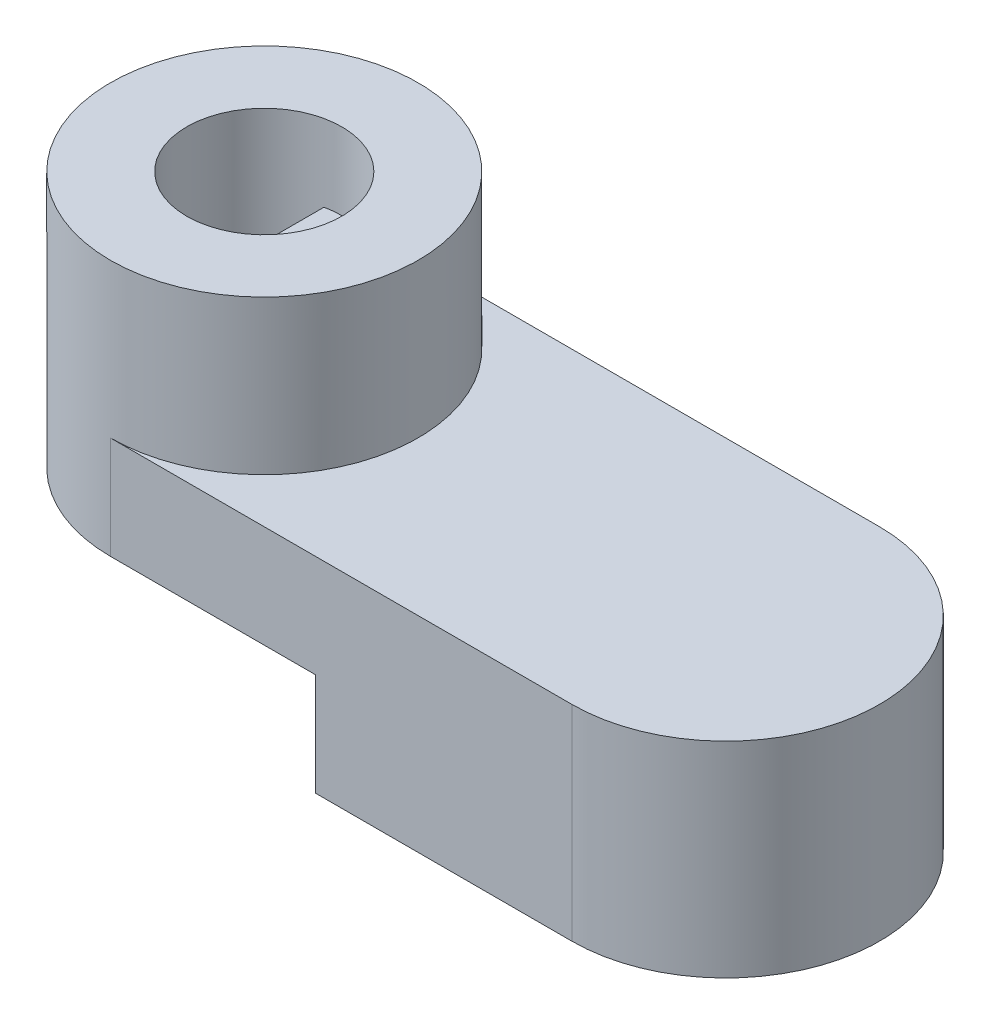
ISO-10303-21;
HEADER;
FILE_DESCRIPTION(('STEP AP214'),'2;1');
FILE_NAME('part.step','',(''),(''),'','','');
FILE_SCHEMA(('AUTOMOTIVE_DESIGN { 1 0 10303 214 1 1 1 1 }'));
ENDSEC;
DATA;
#1=APPLICATION_CONTEXT('core data for automotive mechanical design processes');
#2=APPLICATION_PROTOCOL_DEFINITION('international standard','automotive_design',2000,#1);
#3=PRODUCT_CONTEXT('',#1,'mechanical');
#4=PRODUCT('Part','Part','',(#3));
#5=PRODUCT_RELATED_PRODUCT_CATEGORY('part','',(#4));
#6=PRODUCT_DEFINITION_FORMATION('','',#4);
#7=PRODUCT_DEFINITION_CONTEXT('part definition',#1,'design');
#8=PRODUCT_DEFINITION('design','',#6,#7);
#9=PRODUCT_DEFINITION_SHAPE('','',#8);
#10=(LENGTH_UNIT() NAMED_UNIT(*) SI_UNIT(.MILLI.,.METRE.));
#11=(NAMED_UNIT(*) PLANE_ANGLE_UNIT() SI_UNIT($,.RADIAN.));
#12=(NAMED_UNIT(*) SI_UNIT($,.STERADIAN.) SOLID_ANGLE_UNIT());
#13=UNCERTAINTY_MEASURE_WITH_UNIT(LENGTH_MEASURE(1.E-05),#10,'distance_accuracy_value','');
#14=(GEOMETRIC_REPRESENTATION_CONTEXT(3) GLOBAL_UNCERTAINTY_ASSIGNED_CONTEXT((#13)) GLOBAL_UNIT_ASSIGNED_CONTEXT((#10,
#11,#12)) REPRESENTATION_CONTEXT('',''));
#15=CARTESIAN_POINT('',(0.,0.,0.));
#16=DIRECTION('',(0.,0.,1.));
#17=DIRECTION('',(1.,0.,0.));
#18=AXIS2_PLACEMENT_3D('',#15,#16,#17);
#19=CARTESIAN_POINT('',(-19.05,11.1125,0.));
#20=DIRECTION('',(0.,-1.,0.));
#21=DIRECTION('',(0.,0.,-1.));
#22=AXIS2_PLACEMENT_3D('',#19,#20,#21);
#23=CYLINDRICAL_SURFACE('',#22,2.4);
#24=CARTESIAN_POINT('',(-19.05,11.1125,0.));
#25=DIRECTION('',(0.,1.,0.));
#26=DIRECTION('',(0.,0.,1.));
#27=AXIS2_PLACEMENT_3D('',#24,#25,#26);
#28=CIRCLE('',#27,2.4);
#29=CARTESIAN_POINT('',(-19.05,11.1125,2.4));
#30=VERTEX_POINT('',#29);
#31=EDGE_CURVE('E139',#30,#30,#28,.T.);
#32=ORIENTED_EDGE('',*,*,#31,.T.);
#33=EDGE_LOOP('',(#32));
#34=FACE_BOUND('',#33,.T.);
#35=CARTESIAN_POINT('',(-19.05,8.73124999999999,0.));
#36=DIRECTION('',(0.,1.,0.));
#37=DIRECTION('',(0.,0.,1.));
#38=AXIS2_PLACEMENT_3D('',#35,#36,#37);
#39=CIRCLE('',#38,2.4);
#40=CARTESIAN_POINT('',(-18.55,8.73124999999999,-2.3473389188611));
#41=VERTEX_POINT('',#40);
#42=CARTESIAN_POINT('',(-19.55,8.73124999999999,-2.3473389188611));
#43=VERTEX_POINT('',#42);
#44=EDGE_CURVE('E53',#41,#43,#39,.T.);
#45=ORIENTED_EDGE('',*,*,#44,.F.);
#46=DIRECTION('',(0.,-1.,0.));
#47=VECTOR('',#46,1.);
#48=CARTESIAN_POINT('',(-18.55,8.73124999999999,-2.3473389188611));
#49=LINE('',#48,#47);
#50=CARTESIAN_POINT('',(-18.55,6.34999999999999,-2.3473389188611));
#51=VERTEX_POINT('',#50);
#52=EDGE_CURVE('E135',#41,#51,#49,.T.);
#53=ORIENTED_EDGE('',*,*,#52,.T.);
#54=CARTESIAN_POINT('',(-19.05,6.34999999999999,0.));
#55=DIRECTION('',(0.,1.,0.));
#56=DIRECTION('',(0.,0.,1.));
#57=AXIS2_PLACEMENT_3D('',#54,#55,#56);
#58=CIRCLE('',#57,2.4);
#59=CARTESIAN_POINT('',(-18.55,6.34999999999999,2.3473389188611));
#60=VERTEX_POINT('',#59);
#61=EDGE_CURVE('E113',#60,#51,#58,.T.);
#62=ORIENTED_EDGE('',*,*,#61,.F.);
#63=DIRECTION('',(0.,-1.,0.));
#64=VECTOR('',#63,1.);
#65=CARTESIAN_POINT('',(-18.55,8.73124999999999,2.3473389188611));
#66=LINE('',#65,#64);
#67=CARTESIAN_POINT('',(-18.55,8.73124999999999,2.3473389188611));
#68=VERTEX_POINT('',#67);
#69=EDGE_CURVE('E114',#68,#60,#66,.T.);
#70=ORIENTED_EDGE('',*,*,#69,.F.);
#71=CARTESIAN_POINT('',(-19.05,8.73124999999999,0.));
#72=DIRECTION('',(0.,1.,0.));
#73=DIRECTION('',(0.,0.,1.));
#74=AXIS2_PLACEMENT_3D('',#71,#72,#73);
#75=CIRCLE('',#74,2.4);
#76=CARTESIAN_POINT('',(-19.55,8.73124999999999,2.3473389188611));
#77=VERTEX_POINT('',#76);
#78=EDGE_CURVE('E119',#77,#68,#75,.T.);
#79=ORIENTED_EDGE('',*,*,#78,.F.);
#80=DIRECTION('',(0.,-1.,0.));
#81=VECTOR('',#80,1.);
#82=CARTESIAN_POINT('',(-19.55,8.73124999999999,2.3473389188611));
#83=LINE('',#82,#81);
#84=CARTESIAN_POINT('',(-19.55,6.34999999999999,2.3473389188611));
#85=VERTEX_POINT('',#84);
#86=EDGE_CURVE('E117',#77,#85,#83,.T.);
#87=ORIENTED_EDGE('',*,*,#86,.T.);
#88=CARTESIAN_POINT('',(-19.55,6.34999999999999,-2.3473389188611));
#89=VERTEX_POINT('',#88);
#90=EDGE_CURVE('E108',#89,#85,#58,.T.);
#91=ORIENTED_EDGE('',*,*,#90,.F.);
#92=DIRECTION('',(0.,-1.,0.));
#93=VECTOR('',#92,1.);
#94=CARTESIAN_POINT('',(-19.55,8.73124999999999,-2.3473389188611));
#95=LINE('',#94,#93);
#96=EDGE_CURVE('E49',#43,#89,#95,.T.);
#97=ORIENTED_EDGE('',*,*,#96,.F.);
#98=EDGE_LOOP('',(#45,#53,#62,#70,#79,#87,#91,#97));
#99=FACE_BOUND('',#98,.T.);
#100=ADVANCED_FACE('F34',(#34,#99),#23,.F.);
#101=CARTESIAN_POINT('',(-23.8125,6.34999999999999,4.7625));
#102=DIRECTION('',(0.,-1.,0.));
#103=DIRECTION('',(0.,0.,-1.));
#104=AXIS2_PLACEMENT_3D('',#101,#102,#103);
#105=PLANE('',#104);
#106=DIRECTION('',(0.,0.,-1.));
#107=VECTOR('',#106,1.);
#108=CARTESIAN_POINT('',(-18.55,6.34999999999999,2.3473389188611));
#109=LINE('',#108,#107);
#110=EDGE_CURVE('E126',#60,#51,#109,.T.);
#111=ORIENTED_EDGE('',*,*,#110,.F.);
#112=ORIENTED_EDGE('',*,*,#61,.T.);
#113=EDGE_LOOP('',(#111,#112));
#114=FACE_BOUND('',#113,.T.);
#115=ADVANCED_FACE('F228',(#114),#105,.F.);
#116=DIRECTION('',(0.,0.,1.));
#117=VECTOR('',#116,1.);
#118=CARTESIAN_POINT('',(-19.55,6.34999999999999,2.3473389188611));
#119=LINE('',#118,#117);
#120=EDGE_CURVE('E112',#89,#85,#119,.T.);
#121=ORIENTED_EDGE('',*,*,#120,.F.);
#122=ORIENTED_EDGE('',*,*,#90,.T.);
#123=EDGE_LOOP('',(#121,#122));
#124=FACE_BOUND('',#123,.T.);
#125=ADVANCED_FACE('F110',(#124),#105,.F.);
#126=CARTESIAN_POINT('',(-19.05,6.34999999999999,0.));
#127=DIRECTION('',(0.,1.,0.));
#128=DIRECTION('',(0.,0.,1.));
#129=AXIS2_PLACEMENT_3D('',#126,#127,#128);
#130=CIRCLE('',#129,4.7625);
#131=CARTESIAN_POINT('',(-19.05,6.34999999999999,4.7625));
#132=VERTEX_POINT('',#131);
#133=CARTESIAN_POINT('',(-19.05,6.34999999999999,-4.7625));
#134=VERTEX_POINT('',#133);
#135=EDGE_CURVE('E141',#132,#134,#130,.T.);
#136=ORIENTED_EDGE('',*,*,#135,.F.);
#137=DIRECTION('',(-1.,0.,0.));
#138=VECTOR('',#137,1.);
#139=CARTESIAN_POINT('',(-23.8125,6.34999999999999,4.7625));
#140=LINE('',#139,#138);
#141=CARTESIAN_POINT('',(-4.7625,6.34999999999999,4.7625));
#142=VERTEX_POINT('',#141);
#143=EDGE_CURVE('E169',#142,#132,#140,.T.);
#144=ORIENTED_EDGE('',*,*,#143,.F.);
#145=CARTESIAN_POINT('',(-4.7625,6.34999999999999,0.));
#146=DIRECTION('',(0.,-1.,0.));
#147=DIRECTION('',(0.,0.,-1.));
#148=AXIS2_PLACEMENT_3D('',#145,#146,#147);
#149=CIRCLE('',#148,4.7625);
#150=CARTESIAN_POINT('',(-4.7625,6.34999999999999,-4.7625));
#151=VERTEX_POINT('',#150);
#152=EDGE_CURVE('E153',#142,#151,#149,.F.);
#153=ORIENTED_EDGE('',*,*,#152,.T.);
#154=DIRECTION('',(-1.,0.,0.));
#155=VECTOR('',#154,1.);
#156=CARTESIAN_POINT('',(-23.8125,6.34999999999999,-4.7625));
#157=LINE('',#156,#155);
#158=EDGE_CURVE('E162',#151,#134,#157,.T.);
#159=ORIENTED_EDGE('',*,*,#158,.T.);
#160=EDGE_LOOP('',(#136,#144,#153,#159));
#161=FACE_BOUND('',#160,.T.);
#162=ADVANCED_FACE('F36',(#161),#105,.F.);
#163=CARTESIAN_POINT('',(-12.7,3.175,4.7625));
#164=DIRECTION('',(0.,1.,0.));
#165=DIRECTION('',(-1.,0.,0.));
#166=AXIS2_PLACEMENT_3D('',#163,#164,#165);
#167=PLANE('',#166);
#168=CARTESIAN_POINT('',(-19.05,3.175,0.));
#169=DIRECTION('',(0.,1.,0.));
#170=DIRECTION('',(-1.,0.,0.));
#171=AXIS2_PLACEMENT_3D('',#168,#169,#170);
#172=CIRCLE('',#171,4.7625);
#173=CARTESIAN_POINT('',(-19.05,3.175,4.7625));
#174=VERTEX_POINT('',#173);
#175=CARTESIAN_POINT('',(-19.05,3.175,-4.7625));
#176=VERTEX_POINT('',#175);
#177=EDGE_CURVE('E156',#174,#176,#172,.F.);
#178=ORIENTED_EDGE('',*,*,#177,.T.);
#179=DIRECTION('',(1.,0.,0.));
#180=VECTOR('',#179,1.);
#181=CARTESIAN_POINT('',(-12.7,3.175,-4.7625));
#182=LINE('',#181,#180);
#183=CARTESIAN_POINT('',(-12.7,3.175,-4.7625));
#184=VERTEX_POINT('',#183);
#185=EDGE_CURVE('E182',#176,#184,#182,.T.);
#186=ORIENTED_EDGE('',*,*,#185,.T.);
#187=DIRECTION('',(0.,0.,-1.));
#188=VECTOR('',#187,1.);
#189=CARTESIAN_POINT('',(-12.7,3.175,4.7625));
#190=LINE('',#189,#188);
#191=CARTESIAN_POINT('',(-12.7,3.175,4.7625));
#192=VERTEX_POINT('',#191);
#193=EDGE_CURVE('E12',#192,#184,#190,.T.);
#194=ORIENTED_EDGE('',*,*,#193,.F.);
#195=DIRECTION('',(1.,0.,0.));
#196=VECTOR('',#195,1.);
#197=CARTESIAN_POINT('',(-12.7,3.175,4.7625));
#198=LINE('',#197,#196);
#199=EDGE_CURVE('E172',#174,#192,#198,.T.);
#200=ORIENTED_EDGE('',*,*,#199,.F.);
#201=EDGE_LOOP('',(#178,#186,#194,#200));
#202=FACE_BOUND('',#201,.T.);
#203=ADVANCED_FACE('F212',(#202),#167,.F.);
#204=CARTESIAN_POINT('',(0.,0.,4.7625));
#205=DIRECTION('',(0.,1.,0.));
#206=DIRECTION('',(-1.,0.,0.));
#207=AXIS2_PLACEMENT_3D('',#204,#205,#206);
#208=PLANE('',#207);
#209=CARTESIAN_POINT('',(-4.7625,0.,0.));
#210=DIRECTION('',(0.,-1.,0.));
#211=DIRECTION('',(1.,0.,0.));
#212=AXIS2_PLACEMENT_3D('',#209,#210,#211);
#213=CIRCLE('',#212,4.7625);
#214=CARTESIAN_POINT('',(-4.7625,0.,-4.7625));
#215=VERTEX_POINT('',#214);
#216=CARTESIAN_POINT('',(-4.7625,0.,4.7625));
#217=VERTEX_POINT('',#216);
#218=EDGE_CURVE('E165',#215,#217,#213,.T.);
#219=ORIENTED_EDGE('',*,*,#218,.T.);
#220=DIRECTION('',(1.,0.,0.));
#221=VECTOR('',#220,1.);
#222=CARTESIAN_POINT('',(0.,0.,4.7625));
#223=LINE('',#222,#221);
#224=CARTESIAN_POINT('',(-12.7,0.,4.7625));
#225=VERTEX_POINT('',#224);
#226=EDGE_CURVE('E177',#225,#217,#223,.T.);
#227=ORIENTED_EDGE('',*,*,#226,.F.);
#228=DIRECTION('',(0.,0.,-1.));
#229=VECTOR('',#228,1.);
#230=CARTESIAN_POINT('',(-12.7,0.,4.7625));
#231=LINE('',#230,#229);
#232=CARTESIAN_POINT('',(-12.7,0.,-4.7625));
#233=VERTEX_POINT('',#232);
#234=EDGE_CURVE('E42',#225,#233,#231,.T.);
#235=ORIENTED_EDGE('',*,*,#234,.T.);
#236=DIRECTION('',(1.,0.,0.));
#237=VECTOR('',#236,1.);
#238=CARTESIAN_POINT('',(0.,0.,-4.7625));
#239=LINE('',#238,#237);
#240=EDGE_CURVE('E173',#233,#215,#239,.T.);
#241=ORIENTED_EDGE('',*,*,#240,.T.);
#242=EDGE_LOOP('',(#219,#227,#235,#241));
#243=FACE_BOUND('',#242,.T.);
#244=ADVANCED_FACE('F192',(#243),#208,.F.);
#245=CARTESIAN_POINT('',(0.,0.,4.7625));
#246=DIRECTION('',(0.,0.,-1.));
#247=DIRECTION('',(-1.,0.,0.));
#248=AXIS2_PLACEMENT_3D('',#245,#246,#247);
#249=PLANE('',#248);
#250=DIRECTION('',(0.,-1.,0.));
#251=VECTOR('',#250,1.);
#252=CARTESIAN_POINT('',(-4.7625,6.35099999999999,4.7625));
#253=LINE('',#252,#251);
#254=EDGE_CURVE('E147',#142,#217,#253,.T.);
#255=ORIENTED_EDGE('',*,*,#254,.F.);
#256=ORIENTED_EDGE('',*,*,#143,.T.);
#257=DIRECTION('',(0.,-1.,0.));
#258=VECTOR('',#257,1.);
#259=CARTESIAN_POINT('',(-19.05,6.35099999999999,4.7625));
#260=LINE('',#259,#258);
#261=EDGE_CURVE('E158',#132,#174,#260,.T.);
#262=ORIENTED_EDGE('',*,*,#261,.T.);
#263=ORIENTED_EDGE('',*,*,#199,.T.);
#264=DIRECTION('',(0.,-1.,0.));
#265=VECTOR('',#264,1.);
#266=CARTESIAN_POINT('',(-12.7,0.,4.7625));
#267=LINE('',#266,#265);
#268=EDGE_CURVE('E175',#192,#225,#267,.T.);
#269=ORIENTED_EDGE('',*,*,#268,.T.);
#270=ORIENTED_EDGE('',*,*,#226,.T.);
#271=EDGE_LOOP('',(#255,#256,#262,#263,#269,#270));
#272=FACE_BOUND('',#271,.T.);
#273=ADVANCED_FACE('F207',(#272),#249,.F.);
#274=CARTESIAN_POINT('',(0.,0.,-4.7625));
#275=DIRECTION('',(0.,0.,-1.));
#276=DIRECTION('',(-1.,0.,0.));
#277=AXIS2_PLACEMENT_3D('',#274,#275,#276);
#278=PLANE('',#277);
#279=DIRECTION('',(0.,-1.,0.));
#280=VECTOR('',#279,1.);
#281=CARTESIAN_POINT('',(-19.05,6.35099999999999,-4.7625));
#282=LINE('',#281,#280);
#283=EDGE_CURVE('E150',#134,#176,#282,.T.);
#284=ORIENTED_EDGE('',*,*,#283,.F.);
#285=ORIENTED_EDGE('',*,*,#158,.F.);
#286=DIRECTION('',(0.,-1.,0.));
#287=VECTOR('',#286,1.);
#288=CARTESIAN_POINT('',(-4.7625,6.35099999999999,-4.7625));
#289=LINE('',#288,#287);
#290=EDGE_CURVE('E159',#151,#215,#289,.T.);
#291=ORIENTED_EDGE('',*,*,#290,.T.);
#292=ORIENTED_EDGE('',*,*,#240,.F.);
#293=DIRECTION('',(0.,-1.,0.));
#294=VECTOR('',#293,1.);
#295=CARTESIAN_POINT('',(-12.7,0.,-4.7625));
#296=LINE('',#295,#294);
#297=EDGE_CURVE('E184',#184,#233,#296,.T.);
#298=ORIENTED_EDGE('',*,*,#297,.F.);
#299=ORIENTED_EDGE('',*,*,#185,.F.);
#300=EDGE_LOOP('',(#284,#285,#291,#292,#298,#299));
#301=FACE_BOUND('',#300,.T.);
#302=ADVANCED_FACE('F197',(#301),#278,.T.);
#303=CARTESIAN_POINT('',(-12.7,0.,4.7625));
#304=DIRECTION('',(1.,0.,0.));
#305=DIRECTION('',(0.,0.,-1.));
#306=AXIS2_PLACEMENT_3D('',#303,#304,#305);
#307=PLANE('',#306);
#308=ORIENTED_EDGE('',*,*,#297,.T.);
#309=ORIENTED_EDGE('',*,*,#234,.F.);
#310=ORIENTED_EDGE('',*,*,#268,.F.);
#311=ORIENTED_EDGE('',*,*,#193,.T.);
#312=EDGE_LOOP('',(#308,#309,#310,#311));
#313=FACE_BOUND('',#312,.T.);
#314=ADVANCED_FACE('F210',(#313),#307,.F.);
#315=CARTESIAN_POINT('',(-4.7625,6.35099999999999,0.));
#316=DIRECTION('',(0.,-1.,0.));
#317=DIRECTION('',(1.,0.,0.));
#318=AXIS2_PLACEMENT_3D('',#315,#316,#317);
#319=CYLINDRICAL_SURFACE('',#318,4.7625);
#320=ORIENTED_EDGE('',*,*,#152,.F.);
#321=ORIENTED_EDGE('',*,*,#254,.T.);
#322=ORIENTED_EDGE('',*,*,#218,.F.);
#323=ORIENTED_EDGE('',*,*,#290,.F.);
#324=EDGE_LOOP('',(#320,#321,#322,#323));
#325=FACE_BOUND('',#324,.T.);
#326=ADVANCED_FACE('F201',(#325),#319,.T.);
#327=CARTESIAN_POINT('',(-19.05,6.35099999999999,0.));
#328=DIRECTION('',(0.,-1.,0.));
#329=DIRECTION('',(1.,0.,0.));
#330=AXIS2_PLACEMENT_3D('',#327,#328,#329);
#331=CYLINDRICAL_SURFACE('',#330,4.7625);
#332=ORIENTED_EDGE('',*,*,#261,.F.);
#333=ORIENTED_EDGE('',*,*,#135,.T.);
#334=ORIENTED_EDGE('',*,*,#283,.T.);
#335=ORIENTED_EDGE('',*,*,#177,.F.);
#336=EDGE_LOOP('',(#332,#333,#334,#335));
#337=FACE_BOUND('',#336,.T.);
#338=CARTESIAN_POINT('',(-19.05,11.1125,0.));
#339=DIRECTION('',(0.,1.,0.));
#340=DIRECTION('',(0.,0.,1.));
#341=AXIS2_PLACEMENT_3D('',#338,#339,#340);
#342=CIRCLE('',#341,4.7625);
#343=CARTESIAN_POINT('',(-19.05,11.1125,4.7625));
#344=VERTEX_POINT('',#343);
#345=EDGE_CURVE('E144',#344,#344,#342,.T.);
#346=ORIENTED_EDGE('',*,*,#345,.F.);
#347=EDGE_LOOP('',(#346));
#348=FACE_BOUND('',#347,.T.);
#349=ADVANCED_FACE('F214',(#337,#348),#331,.T.);
#350=CARTESIAN_POINT('',(-19.05,11.1125,0.));
#351=DIRECTION('',(0.,1.,0.));
#352=DIRECTION('',(0.,0.,1.));
#353=AXIS2_PLACEMENT_3D('',#350,#351,#352);
#354=PLANE('',#353);
#355=ORIENTED_EDGE('',*,*,#345,.T.);
#356=EDGE_LOOP('',(#355));
#357=FACE_BOUND('',#356,.T.);
#358=ORIENTED_EDGE('',*,*,#31,.F.);
#359=EDGE_LOOP('',(#358));
#360=FACE_BOUND('',#359,.T.);
#361=ADVANCED_FACE('F217',(#357,#360),#354,.T.);
#362=CARTESIAN_POINT('',(-18.55,8.73124999999999,2.3473389188611));
#363=DIRECTION('',(-1.,0.,0.));
#364=DIRECTION('',(0.,0.,1.));
#365=AXIS2_PLACEMENT_3D('',#362,#363,#364);
#366=PLANE('',#365);
#367=ORIENTED_EDGE('',*,*,#110,.T.);
#368=ORIENTED_EDGE('',*,*,#52,.F.);
#369=DIRECTION('',(0.,0.,-1.));
#370=VECTOR('',#369,1.);
#371=CARTESIAN_POINT('',(-18.55,8.73124999999999,2.3473389188611));
#372=LINE('',#371,#370);
#373=EDGE_CURVE('E128',#68,#41,#372,.T.);
#374=ORIENTED_EDGE('',*,*,#373,.F.);
#375=ORIENTED_EDGE('',*,*,#69,.T.);
#376=EDGE_LOOP('',(#367,#368,#374,#375));
#377=FACE_BOUND('',#376,.T.);
#378=ADVANCED_FACE('F223',(#377),#366,.F.);
#379=CARTESIAN_POINT('',(-19.55,8.73124999999999,2.3473389188611));
#380=DIRECTION('',(1.,0.,0.));
#381=DIRECTION('',(0.,0.,-1.));
#382=AXIS2_PLACEMENT_3D('',#379,#380,#381);
#383=PLANE('',#382);
#384=ORIENTED_EDGE('',*,*,#120,.T.);
#385=ORIENTED_EDGE('',*,*,#86,.F.);
#386=DIRECTION('',(0.,0.,1.));
#387=VECTOR('',#386,1.);
#388=CARTESIAN_POINT('',(-19.55,8.73124999999999,2.3473389188611));
#389=LINE('',#388,#387);
#390=EDGE_CURVE('E123',#43,#77,#389,.T.);
#391=ORIENTED_EDGE('',*,*,#390,.F.);
#392=ORIENTED_EDGE('',*,*,#96,.T.);
#393=EDGE_LOOP('',(#384,#385,#391,#392));
#394=FACE_BOUND('',#393,.T.);
#395=ADVANCED_FACE('F125',(#394),#383,.F.);
#396=CARTESIAN_POINT('',(-19.05,8.73124999999999,0.));
#397=DIRECTION('',(0.,1.,0.));
#398=DIRECTION('',(0.,0.,1.));
#399=AXIS2_PLACEMENT_3D('',#396,#397,#398);
#400=PLANE('',#399);
#401=ORIENTED_EDGE('',*,*,#78,.T.);
#402=ORIENTED_EDGE('',*,*,#373,.T.);
#403=ORIENTED_EDGE('',*,*,#44,.T.);
#404=ORIENTED_EDGE('',*,*,#390,.T.);
#405=EDGE_LOOP('',(#401,#402,#403,#404));
#406=FACE_BOUND('',#405,.T.);
#407=ADVANCED_FACE('F336',(#406),#400,.T.);
#408=CLOSED_SHELL('',(#100,#115,#125,#162,#203,#244,#273,#302,#314,#326,#349,#361,#378,#395,#407));
#409=MANIFOLD_SOLID_BREP('B2',#408);
#410=ADVANCED_BREP_SHAPE_REPRESENTATION('',(#18,#409),#14);
#411=SHAPE_DEFINITION_REPRESENTATION(#9,#410);
ENDSEC;
END-ISO-10303-21;
